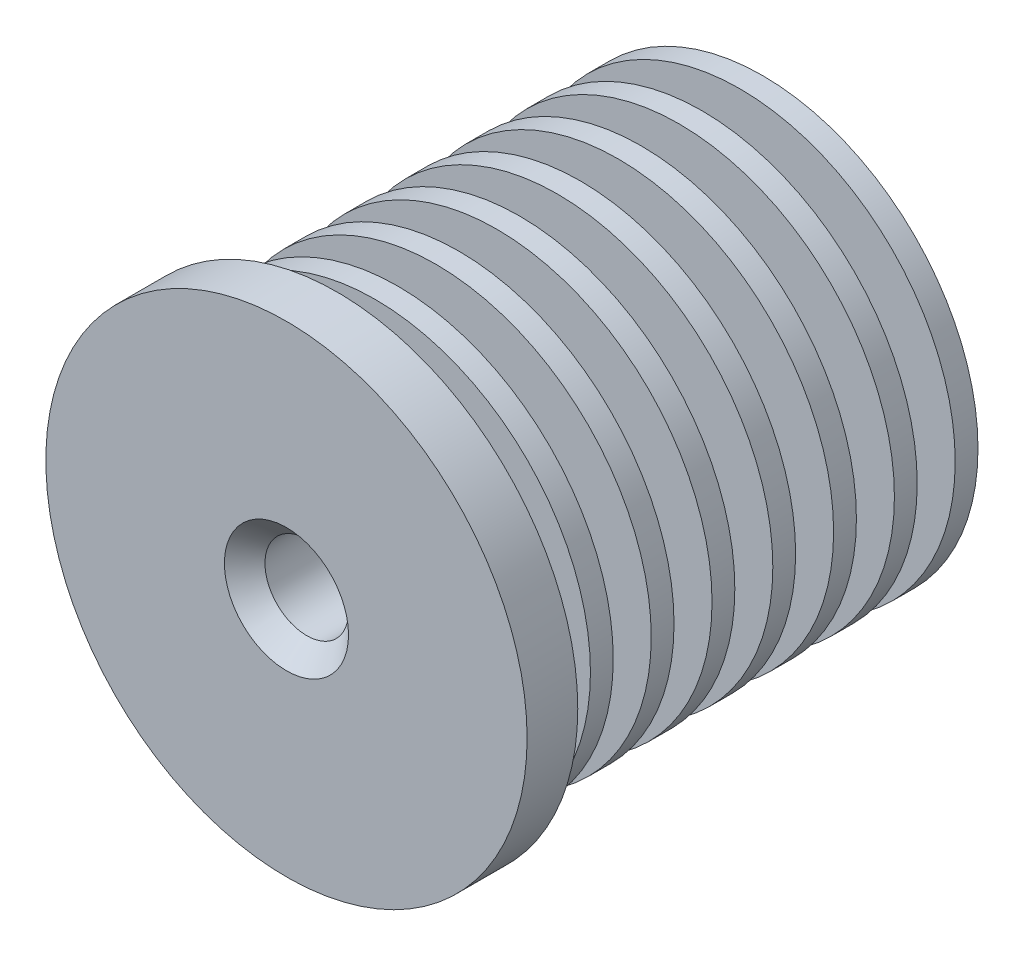
ISO-10303-21;
HEADER;
FILE_DESCRIPTION(('STEP AP214'),'2;1');
FILE_NAME('part.step','',(''),(''),'','','');
FILE_SCHEMA(('AUTOMOTIVE_DESIGN { 1 0 10303 214 1 1 1 1 }'));
ENDSEC;
DATA;
#1=APPLICATION_CONTEXT('core data for automotive mechanical design processes');
#2=APPLICATION_PROTOCOL_DEFINITION('international standard','automotive_design',2000,#1);
#3=PRODUCT_CONTEXT('',#1,'mechanical');
#4=PRODUCT('Part','Part','',(#3));
#5=PRODUCT_RELATED_PRODUCT_CATEGORY('part','',(#4));
#6=PRODUCT_DEFINITION_FORMATION('','',#4);
#7=PRODUCT_DEFINITION_CONTEXT('part definition',#1,'design');
#8=PRODUCT_DEFINITION('design','',#6,#7);
#9=PRODUCT_DEFINITION_SHAPE('','',#8);
#10=(LENGTH_UNIT() NAMED_UNIT(*) SI_UNIT(.MILLI.,.METRE.));
#11=(NAMED_UNIT(*) PLANE_ANGLE_UNIT() SI_UNIT($,.RADIAN.));
#12=(NAMED_UNIT(*) SI_UNIT($,.STERADIAN.) SOLID_ANGLE_UNIT());
#13=UNCERTAINTY_MEASURE_WITH_UNIT(LENGTH_MEASURE(1.E-05),#10,'distance_accuracy_value','');
#14=(GEOMETRIC_REPRESENTATION_CONTEXT(3) GLOBAL_UNCERTAINTY_ASSIGNED_CONTEXT((#13)) GLOBAL_UNIT_ASSIGNED_CONTEXT((#10,
#11,#12)) REPRESENTATION_CONTEXT('',''));
#15=CARTESIAN_POINT('',(0.,0.,0.));
#16=DIRECTION('',(0.,0.,1.));
#17=DIRECTION('',(1.,0.,0.));
#18=AXIS2_PLACEMENT_3D('',#15,#16,#17);
#19=CARTESIAN_POINT('',(0.,0.,0.));
#20=DIRECTION('',(0.,0.,1.));
#21=DIRECTION('',(1.,0.,0.));
#22=AXIS2_PLACEMENT_3D('',#19,#20,#21);
#23=CYLINDRICAL_SURFACE('',#22,6.);
#24=CARTESIAN_POINT('',(0.,0.,-3.5));
#25=DIRECTION('',(0.,0.,1.));
#26=DIRECTION('',(1.,0.,0.));
#27=AXIS2_PLACEMENT_3D('',#24,#25,#26);
#28=CIRCLE('',#27,6.);
#29=CARTESIAN_POINT('',(6.,0.,-3.5));
#30=VERTEX_POINT('',#29);
#31=EDGE_CURVE('E174',#30,#30,#28,.T.);
#32=ORIENTED_EDGE('',*,*,#31,.T.);
#33=EDGE_LOOP('',(#32));
#34=FACE_BOUND('',#33,.T.);
#35=CARTESIAN_POINT('',(0.,0.,-2.));
#36=DIRECTION('',(0.,0.,1.));
#37=DIRECTION('',(1.,0.,0.));
#38=AXIS2_PLACEMENT_3D('',#35,#36,#37);
#39=CIRCLE('',#38,6.);
#40=CARTESIAN_POINT('',(6.,0.,-2.));
#41=VERTEX_POINT('',#40);
#42=EDGE_CURVE('E52',#41,#41,#39,.T.);
#43=ORIENTED_EDGE('',*,*,#42,.F.);
#44=EDGE_LOOP('',(#43));
#45=FACE_BOUND('',#44,.T.);
#46=ADVANCED_FACE('F38',(#34,#45),#23,.T.);
#47=CARTESIAN_POINT('',(9.5,0.,-2.));
#48=DIRECTION('',(0.,0.,-1.));
#49=DIRECTION('',(-1.,0.,0.));
#50=AXIS2_PLACEMENT_3D('',#47,#48,#49);
#51=PLANE('',#50);
#52=ORIENTED_EDGE('',*,*,#42,.T.);
#53=EDGE_LOOP('',(#52));
#54=FACE_BOUND('',#53,.T.);
#55=CARTESIAN_POINT('',(0.,0.,-2.));
#56=DIRECTION('',(0.,0.,1.));
#57=DIRECTION('',(1.,0.,0.));
#58=AXIS2_PLACEMENT_3D('',#55,#56,#57);
#59=CIRCLE('',#58,9.5);
#60=CARTESIAN_POINT('',(9.5,0.,-2.));
#61=VERTEX_POINT('',#60);
#62=EDGE_CURVE('E57',#61,#61,#59,.T.);
#63=ORIENTED_EDGE('',*,*,#62,.F.);
#64=EDGE_LOOP('',(#63));
#65=FACE_BOUND('',#64,.T.);
#66=ADVANCED_FACE('F195',(#54,#65),#51,.T.);
#67=CARTESIAN_POINT('',(0.,0.,0.));
#68=DIRECTION('',(0.,0.,1.));
#69=DIRECTION('',(1.,0.,0.));
#70=AXIS2_PLACEMENT_3D('',#67,#68,#69);
#71=CYLINDRICAL_SURFACE('',#70,9.5);
#72=ORIENTED_EDGE('',*,*,#62,.T.);
#73=EDGE_LOOP('',(#72));
#74=FACE_BOUND('',#73,.T.);
#75=CARTESIAN_POINT('',(0.,0.,0.));
#76=DIRECTION('',(0.,0.,1.));
#77=DIRECTION('',(1.,0.,0.));
#78=AXIS2_PLACEMENT_3D('',#75,#76,#77);
#79=CIRCLE('',#78,9.5);
#80=CARTESIAN_POINT('',(9.5,0.,0.));
#81=VERTEX_POINT('',#80);
#82=EDGE_CURVE('E63',#81,#81,#79,.T.);
#83=ORIENTED_EDGE('',*,*,#82,.F.);
#84=EDGE_LOOP('',(#83));
#85=FACE_BOUND('',#84,.T.);
#86=ADVANCED_FACE('F199',(#74,#85),#71,.T.);
#87=CARTESIAN_POINT('',(1.65,0.,0.));
#88=DIRECTION('',(0.,0.,1.));
#89=DIRECTION('',(1.,0.,0.));
#90=AXIS2_PLACEMENT_3D('',#87,#88,#89);
#91=PLANE('',#90);
#92=CARTESIAN_POINT('',(0.,0.,0.));
#93=DIRECTION('',(0.,0.,1.));
#94=DIRECTION('',(1.,0.,0.));
#95=AXIS2_PLACEMENT_3D('',#92,#93,#94);
#96=CIRCLE('',#95,2.45);
#97=CARTESIAN_POINT('',(2.45,0.,0.));
#98=VERTEX_POINT('',#97);
#99=EDGE_CURVE('E10',#98,#98,#96,.F.);
#100=ORIENTED_EDGE('',*,*,#99,.T.);
#101=EDGE_LOOP('',(#100));
#102=FACE_BOUND('',#101,.T.);
#103=ORIENTED_EDGE('',*,*,#82,.T.);
#104=EDGE_LOOP('',(#103));
#105=FACE_BOUND('',#104,.T.);
#106=ADVANCED_FACE('F205',(#102,#105),#91,.T.);
#107=CARTESIAN_POINT('',(0.,0.,0.));
#108=DIRECTION('',(0.,0.,1.));
#109=DIRECTION('',(1.,0.,0.));
#110=AXIS2_PLACEMENT_3D('',#107,#108,#109);
#111=CYLINDRICAL_SURFACE('',#110,1.65);
#112=CARTESIAN_POINT('',(0.,0.,-0.799999999999995));
#113=DIRECTION('',(0.,0.,1.));
#114=DIRECTION('',(1.,0.,0.));
#115=AXIS2_PLACEMENT_3D('',#112,#113,#114);
#116=CIRCLE('',#115,1.65);
#117=CARTESIAN_POINT('',(1.65,0.,-0.799999999999995));
#118=VERTEX_POINT('',#117);
#119=EDGE_CURVE('E46',#118,#118,#116,.T.);
#120=ORIENTED_EDGE('',*,*,#119,.T.);
#121=EDGE_LOOP('',(#120));
#122=FACE_BOUND('',#121,.T.);
#123=CARTESIAN_POINT('',(0.,0.,-18.8));
#124=DIRECTION('',(0.,0.,1.));
#125=DIRECTION('',(1.,0.,0.));
#126=AXIS2_PLACEMENT_3D('',#123,#124,#125);
#127=CIRCLE('',#126,1.65);
#128=CARTESIAN_POINT('',(1.65,0.,-18.8));
#129=VERTEX_POINT('',#128);
#130=EDGE_CURVE('E67',#129,#129,#127,.T.);
#131=ORIENTED_EDGE('',*,*,#130,.F.);
#132=EDGE_LOOP('',(#131));
#133=FACE_BOUND('',#132,.T.);
#134=ADVANCED_FACE('F209',(#122,#133),#111,.F.);
#135=CARTESIAN_POINT('',(8.5,0.,-18.8));
#136=DIRECTION('',(0.,0.,-1.));
#137=DIRECTION('',(-1.,0.,0.));
#138=AXIS2_PLACEMENT_3D('',#135,#136,#137);
#139=PLANE('',#138);
#140=ORIENTED_EDGE('',*,*,#130,.T.);
#141=EDGE_LOOP('',(#140));
#142=FACE_BOUND('',#141,.T.);
#143=CARTESIAN_POINT('',(0.,0.,-18.8));
#144=DIRECTION('',(0.,0.,1.));
#145=DIRECTION('',(1.,0.,0.));
#146=AXIS2_PLACEMENT_3D('',#143,#144,#145);
#147=CIRCLE('',#146,8.5);
#148=CARTESIAN_POINT('',(8.5,0.,-18.8));
#149=VERTEX_POINT('',#148);
#150=EDGE_CURVE('E70',#149,#149,#147,.T.);
#151=ORIENTED_EDGE('',*,*,#150,.F.);
#152=EDGE_LOOP('',(#151));
#153=FACE_BOUND('',#152,.T.);
#154=ADVANCED_FACE('F212',(#142,#153),#139,.T.);
#155=CARTESIAN_POINT('',(0.,0.,0.));
#156=DIRECTION('',(0.,0.,1.));
#157=DIRECTION('',(1.,0.,0.));
#158=AXIS2_PLACEMENT_3D('',#155,#156,#157);
#159=CYLINDRICAL_SURFACE('',#158,8.5);
#160=ORIENTED_EDGE('',*,*,#150,.T.);
#161=EDGE_LOOP('',(#160));
#162=FACE_BOUND('',#161,.T.);
#163=CARTESIAN_POINT('',(0.,0.,-17.9));
#164=DIRECTION('',(0.,0.,1.));
#165=DIRECTION('',(1.,0.,0.));
#166=AXIS2_PLACEMENT_3D('',#163,#164,#165);
#167=CIRCLE('',#166,8.5);
#168=CARTESIAN_POINT('',(8.5,0.,-17.9));
#169=VERTEX_POINT('',#168);
#170=EDGE_CURVE('E74',#169,#169,#167,.T.);
#171=ORIENTED_EDGE('',*,*,#170,.F.);
#172=EDGE_LOOP('',(#171));
#173=FACE_BOUND('',#172,.T.);
#174=ADVANCED_FACE('F215',(#162,#173),#159,.T.);
#175=CARTESIAN_POINT('',(3.5,0.,-17.9));
#176=DIRECTION('',(0.,0.,1.));
#177=DIRECTION('',(1.,0.,0.));
#178=AXIS2_PLACEMENT_3D('',#175,#176,#177);
#179=PLANE('',#178);
#180=ORIENTED_EDGE('',*,*,#170,.T.);
#181=EDGE_LOOP('',(#180));
#182=FACE_BOUND('',#181,.T.);
#183=CARTESIAN_POINT('',(0.,0.,-17.9));
#184=DIRECTION('',(0.,0.,1.));
#185=DIRECTION('',(1.,0.,0.));
#186=AXIS2_PLACEMENT_3D('',#183,#184,#185);
#187=CIRCLE('',#186,3.5);
#188=CARTESIAN_POINT('',(3.5,0.,-17.9));
#189=VERTEX_POINT('',#188);
#190=EDGE_CURVE('E78',#189,#189,#187,.T.);
#191=ORIENTED_EDGE('',*,*,#190,.F.);
#192=EDGE_LOOP('',(#191));
#193=FACE_BOUND('',#192,.T.);
#194=ADVANCED_FACE('F219',(#182,#193),#179,.T.);
#195=CARTESIAN_POINT('',(0.,0.,0.));
#196=DIRECTION('',(0.,0.,1.));
#197=DIRECTION('',(1.,0.,0.));
#198=AXIS2_PLACEMENT_3D('',#195,#196,#197);
#199=CYLINDRICAL_SURFACE('',#198,3.5);
#200=ORIENTED_EDGE('',*,*,#190,.T.);
#201=EDGE_LOOP('',(#200));
#202=FACE_BOUND('',#201,.T.);
#203=CARTESIAN_POINT('',(0.,0.,-16.4));
#204=DIRECTION('',(0.,0.,1.));
#205=DIRECTION('',(1.,0.,0.));
#206=AXIS2_PLACEMENT_3D('',#203,#204,#205);
#207=CIRCLE('',#206,3.5);
#208=CARTESIAN_POINT('',(3.5,0.,-16.4));
#209=VERTEX_POINT('',#208);
#210=EDGE_CURVE('E82',#209,#209,#207,.T.);
#211=ORIENTED_EDGE('',*,*,#210,.F.);
#212=EDGE_LOOP('',(#211));
#213=FACE_BOUND('',#212,.T.);
#214=ADVANCED_FACE('F223',(#202,#213),#199,.T.);
#215=CARTESIAN_POINT('',(8.5,0.,-16.4));
#216=DIRECTION('',(0.,0.,-1.));
#217=DIRECTION('',(-1.,0.,0.));
#218=AXIS2_PLACEMENT_3D('',#215,#216,#217);
#219=PLANE('',#218);
#220=ORIENTED_EDGE('',*,*,#210,.T.);
#221=EDGE_LOOP('',(#220));
#222=FACE_BOUND('',#221,.T.);
#223=CARTESIAN_POINT('',(0.,0.,-16.4));
#224=DIRECTION('',(0.,0.,1.));
#225=DIRECTION('',(1.,0.,0.));
#226=AXIS2_PLACEMENT_3D('',#223,#224,#225);
#227=CIRCLE('',#226,8.5);
#228=CARTESIAN_POINT('',(8.5,0.,-16.4));
#229=VERTEX_POINT('',#228);
#230=EDGE_CURVE('E86',#229,#229,#227,.T.);
#231=ORIENTED_EDGE('',*,*,#230,.F.);
#232=EDGE_LOOP('',(#231));
#233=FACE_BOUND('',#232,.T.);
#234=ADVANCED_FACE('F227',(#222,#233),#219,.T.);
#235=CARTESIAN_POINT('',(0.,0.,0.));
#236=DIRECTION('',(0.,0.,1.));
#237=DIRECTION('',(1.,0.,0.));
#238=AXIS2_PLACEMENT_3D('',#235,#236,#237);
#239=CYLINDRICAL_SURFACE('',#238,8.5);
#240=ORIENTED_EDGE('',*,*,#230,.T.);
#241=EDGE_LOOP('',(#240));
#242=FACE_BOUND('',#241,.T.);
#243=CARTESIAN_POINT('',(0.,0.,-15.5));
#244=DIRECTION('',(0.,0.,1.));
#245=DIRECTION('',(1.,0.,0.));
#246=AXIS2_PLACEMENT_3D('',#243,#244,#245);
#247=CIRCLE('',#246,8.5);
#248=CARTESIAN_POINT('',(8.5,0.,-15.5));
#249=VERTEX_POINT('',#248);
#250=EDGE_CURVE('E90',#249,#249,#247,.T.);
#251=ORIENTED_EDGE('',*,*,#250,.F.);
#252=EDGE_LOOP('',(#251));
#253=FACE_BOUND('',#252,.T.);
#254=ADVANCED_FACE('F231',(#242,#253),#239,.T.);
#255=CARTESIAN_POINT('',(3.5,0.,-15.5));
#256=DIRECTION('',(0.,0.,1.));
#257=DIRECTION('',(1.,0.,0.));
#258=AXIS2_PLACEMENT_3D('',#255,#256,#257);
#259=PLANE('',#258);
#260=ORIENTED_EDGE('',*,*,#250,.T.);
#261=EDGE_LOOP('',(#260));
#262=FACE_BOUND('',#261,.T.);
#263=CARTESIAN_POINT('',(0.,0.,-15.5));
#264=DIRECTION('',(0.,0.,1.));
#265=DIRECTION('',(1.,0.,0.));
#266=AXIS2_PLACEMENT_3D('',#263,#264,#265);
#267=CIRCLE('',#266,3.5);
#268=CARTESIAN_POINT('',(3.5,0.,-15.5));
#269=VERTEX_POINT('',#268);
#270=EDGE_CURVE('E94',#269,#269,#267,.T.);
#271=ORIENTED_EDGE('',*,*,#270,.F.);
#272=EDGE_LOOP('',(#271));
#273=FACE_BOUND('',#272,.T.);
#274=ADVANCED_FACE('F235',(#262,#273),#259,.T.);
#275=CARTESIAN_POINT('',(0.,0.,0.));
#276=DIRECTION('',(0.,0.,1.));
#277=DIRECTION('',(1.,0.,0.));
#278=AXIS2_PLACEMENT_3D('',#275,#276,#277);
#279=CYLINDRICAL_SURFACE('',#278,3.5);
#280=ORIENTED_EDGE('',*,*,#270,.T.);
#281=EDGE_LOOP('',(#280));
#282=FACE_BOUND('',#281,.T.);
#283=CARTESIAN_POINT('',(0.,0.,-14.));
#284=DIRECTION('',(0.,0.,1.));
#285=DIRECTION('',(1.,0.,0.));
#286=AXIS2_PLACEMENT_3D('',#283,#284,#285);
#287=CIRCLE('',#286,3.5);
#288=CARTESIAN_POINT('',(3.5,0.,-14.));
#289=VERTEX_POINT('',#288);
#290=EDGE_CURVE('E98',#289,#289,#287,.T.);
#291=ORIENTED_EDGE('',*,*,#290,.F.);
#292=EDGE_LOOP('',(#291));
#293=FACE_BOUND('',#292,.T.);
#294=ADVANCED_FACE('F239',(#282,#293),#279,.T.);
#295=CARTESIAN_POINT('',(8.5,0.,-14.));
#296=DIRECTION('',(0.,0.,-1.));
#297=DIRECTION('',(-1.,0.,0.));
#298=AXIS2_PLACEMENT_3D('',#295,#296,#297);
#299=PLANE('',#298);
#300=ORIENTED_EDGE('',*,*,#290,.T.);
#301=EDGE_LOOP('',(#300));
#302=FACE_BOUND('',#301,.T.);
#303=CARTESIAN_POINT('',(0.,0.,-14.));
#304=DIRECTION('',(0.,0.,1.));
#305=DIRECTION('',(1.,0.,0.));
#306=AXIS2_PLACEMENT_3D('',#303,#304,#305);
#307=CIRCLE('',#306,8.5);
#308=CARTESIAN_POINT('',(8.5,0.,-14.));
#309=VERTEX_POINT('',#308);
#310=EDGE_CURVE('E102',#309,#309,#307,.T.);
#311=ORIENTED_EDGE('',*,*,#310,.F.);
#312=EDGE_LOOP('',(#311));
#313=FACE_BOUND('',#312,.T.);
#314=ADVANCED_FACE('F243',(#302,#313),#299,.T.);
#315=CARTESIAN_POINT('',(0.,0.,0.));
#316=DIRECTION('',(0.,0.,1.));
#317=DIRECTION('',(1.,0.,0.));
#318=AXIS2_PLACEMENT_3D('',#315,#316,#317);
#319=CYLINDRICAL_SURFACE('',#318,8.5);
#320=ORIENTED_EDGE('',*,*,#310,.T.);
#321=EDGE_LOOP('',(#320));
#322=FACE_BOUND('',#321,.T.);
#323=CARTESIAN_POINT('',(0.,0.,-13.1));
#324=DIRECTION('',(0.,0.,1.));
#325=DIRECTION('',(1.,0.,0.));
#326=AXIS2_PLACEMENT_3D('',#323,#324,#325);
#327=CIRCLE('',#326,8.5);
#328=CARTESIAN_POINT('',(8.5,0.,-13.1));
#329=VERTEX_POINT('',#328);
#330=EDGE_CURVE('E106',#329,#329,#327,.T.);
#331=ORIENTED_EDGE('',*,*,#330,.F.);
#332=EDGE_LOOP('',(#331));
#333=FACE_BOUND('',#332,.T.);
#334=ADVANCED_FACE('F247',(#322,#333),#319,.T.);
#335=CARTESIAN_POINT('',(3.5,0.,-13.1));
#336=DIRECTION('',(0.,0.,1.));
#337=DIRECTION('',(1.,0.,0.));
#338=AXIS2_PLACEMENT_3D('',#335,#336,#337);
#339=PLANE('',#338);
#340=ORIENTED_EDGE('',*,*,#330,.T.);
#341=EDGE_LOOP('',(#340));
#342=FACE_BOUND('',#341,.T.);
#343=CARTESIAN_POINT('',(0.,0.,-13.1));
#344=DIRECTION('',(0.,0.,1.));
#345=DIRECTION('',(1.,0.,0.));
#346=AXIS2_PLACEMENT_3D('',#343,#344,#345);
#347=CIRCLE('',#346,3.5);
#348=CARTESIAN_POINT('',(3.5,0.,-13.1));
#349=VERTEX_POINT('',#348);
#350=EDGE_CURVE('E110',#349,#349,#347,.T.);
#351=ORIENTED_EDGE('',*,*,#350,.F.);
#352=EDGE_LOOP('',(#351));
#353=FACE_BOUND('',#352,.T.);
#354=ADVANCED_FACE('F251',(#342,#353),#339,.T.);
#355=CARTESIAN_POINT('',(0.,0.,0.));
#356=DIRECTION('',(0.,0.,1.));
#357=DIRECTION('',(1.,0.,0.));
#358=AXIS2_PLACEMENT_3D('',#355,#356,#357);
#359=CYLINDRICAL_SURFACE('',#358,3.5);
#360=ORIENTED_EDGE('',*,*,#350,.T.);
#361=EDGE_LOOP('',(#360));
#362=FACE_BOUND('',#361,.T.);
#363=CARTESIAN_POINT('',(0.,0.,-11.6));
#364=DIRECTION('',(0.,0.,1.));
#365=DIRECTION('',(1.,0.,0.));
#366=AXIS2_PLACEMENT_3D('',#363,#364,#365);
#367=CIRCLE('',#366,3.5);
#368=CARTESIAN_POINT('',(3.5,0.,-11.6));
#369=VERTEX_POINT('',#368);
#370=EDGE_CURVE('E114',#369,#369,#367,.T.);
#371=ORIENTED_EDGE('',*,*,#370,.F.);
#372=EDGE_LOOP('',(#371));
#373=FACE_BOUND('',#372,.T.);
#374=ADVANCED_FACE('F255',(#362,#373),#359,.T.);
#375=CARTESIAN_POINT('',(8.5,0.,-11.6));
#376=DIRECTION('',(0.,0.,-1.));
#377=DIRECTION('',(-1.,0.,0.));
#378=AXIS2_PLACEMENT_3D('',#375,#376,#377);
#379=PLANE('',#378);
#380=ORIENTED_EDGE('',*,*,#370,.T.);
#381=EDGE_LOOP('',(#380));
#382=FACE_BOUND('',#381,.T.);
#383=CARTESIAN_POINT('',(0.,0.,-11.6));
#384=DIRECTION('',(0.,0.,1.));
#385=DIRECTION('',(1.,0.,0.));
#386=AXIS2_PLACEMENT_3D('',#383,#384,#385);
#387=CIRCLE('',#386,8.5);
#388=CARTESIAN_POINT('',(8.5,0.,-11.6));
#389=VERTEX_POINT('',#388);
#390=EDGE_CURVE('E118',#389,#389,#387,.T.);
#391=ORIENTED_EDGE('',*,*,#390,.F.);
#392=EDGE_LOOP('',(#391));
#393=FACE_BOUND('',#392,.T.);
#394=ADVANCED_FACE('F259',(#382,#393),#379,.T.);
#395=CARTESIAN_POINT('',(0.,0.,0.));
#396=DIRECTION('',(0.,0.,1.));
#397=DIRECTION('',(1.,0.,0.));
#398=AXIS2_PLACEMENT_3D('',#395,#396,#397);
#399=CYLINDRICAL_SURFACE('',#398,8.5);
#400=ORIENTED_EDGE('',*,*,#390,.T.);
#401=EDGE_LOOP('',(#400));
#402=FACE_BOUND('',#401,.T.);
#403=CARTESIAN_POINT('',(0.,0.,-10.7));
#404=DIRECTION('',(0.,0.,1.));
#405=DIRECTION('',(1.,0.,0.));
#406=AXIS2_PLACEMENT_3D('',#403,#404,#405);
#407=CIRCLE('',#406,8.5);
#408=CARTESIAN_POINT('',(8.5,0.,-10.7));
#409=VERTEX_POINT('',#408);
#410=EDGE_CURVE('E122',#409,#409,#407,.T.);
#411=ORIENTED_EDGE('',*,*,#410,.F.);
#412=EDGE_LOOP('',(#411));
#413=FACE_BOUND('',#412,.T.);
#414=ADVANCED_FACE('F263',(#402,#413),#399,.T.);
#415=CARTESIAN_POINT('',(3.5,0.,-10.7));
#416=DIRECTION('',(0.,0.,1.));
#417=DIRECTION('',(1.,0.,0.));
#418=AXIS2_PLACEMENT_3D('',#415,#416,#417);
#419=PLANE('',#418);
#420=ORIENTED_EDGE('',*,*,#410,.T.);
#421=EDGE_LOOP('',(#420));
#422=FACE_BOUND('',#421,.T.);
#423=CARTESIAN_POINT('',(0.,0.,-10.7));
#424=DIRECTION('',(0.,0.,1.));
#425=DIRECTION('',(1.,0.,0.));
#426=AXIS2_PLACEMENT_3D('',#423,#424,#425);
#427=CIRCLE('',#426,3.5);
#428=CARTESIAN_POINT('',(3.5,0.,-10.7));
#429=VERTEX_POINT('',#428);
#430=EDGE_CURVE('E126',#429,#429,#427,.T.);
#431=ORIENTED_EDGE('',*,*,#430,.F.);
#432=EDGE_LOOP('',(#431));
#433=FACE_BOUND('',#432,.T.);
#434=ADVANCED_FACE('F267',(#422,#433),#419,.T.);
#435=CARTESIAN_POINT('',(0.,0.,0.));
#436=DIRECTION('',(0.,0.,1.));
#437=DIRECTION('',(1.,0.,0.));
#438=AXIS2_PLACEMENT_3D('',#435,#436,#437);
#439=CYLINDRICAL_SURFACE('',#438,3.5);
#440=ORIENTED_EDGE('',*,*,#430,.T.);
#441=EDGE_LOOP('',(#440));
#442=FACE_BOUND('',#441,.T.);
#443=CARTESIAN_POINT('',(0.,0.,-9.19999999999999));
#444=DIRECTION('',(0.,0.,1.));
#445=DIRECTION('',(1.,0.,0.));
#446=AXIS2_PLACEMENT_3D('',#443,#444,#445);
#447=CIRCLE('',#446,3.5);
#448=CARTESIAN_POINT('',(3.5,0.,-9.19999999999999));
#449=VERTEX_POINT('',#448);
#450=EDGE_CURVE('E130',#449,#449,#447,.T.);
#451=ORIENTED_EDGE('',*,*,#450,.F.);
#452=EDGE_LOOP('',(#451));
#453=FACE_BOUND('',#452,.T.);
#454=ADVANCED_FACE('F271',(#442,#453),#439,.T.);
#455=CARTESIAN_POINT('',(8.5,0.,-9.19999999999999));
#456=DIRECTION('',(0.,0.,-1.));
#457=DIRECTION('',(-1.,0.,0.));
#458=AXIS2_PLACEMENT_3D('',#455,#456,#457);
#459=PLANE('',#458);
#460=ORIENTED_EDGE('',*,*,#450,.T.);
#461=EDGE_LOOP('',(#460));
#462=FACE_BOUND('',#461,.T.);
#463=CARTESIAN_POINT('',(0.,0.,-9.19999999999999));
#464=DIRECTION('',(0.,0.,1.));
#465=DIRECTION('',(1.,0.,0.));
#466=AXIS2_PLACEMENT_3D('',#463,#464,#465);
#467=CIRCLE('',#466,8.5);
#468=CARTESIAN_POINT('',(8.5,0.,-9.19999999999999));
#469=VERTEX_POINT('',#468);
#470=EDGE_CURVE('E134',#469,#469,#467,.T.);
#471=ORIENTED_EDGE('',*,*,#470,.F.);
#472=EDGE_LOOP('',(#471));
#473=FACE_BOUND('',#472,.T.);
#474=ADVANCED_FACE('F275',(#462,#473),#459,.T.);
#475=CARTESIAN_POINT('',(0.,0.,0.));
#476=DIRECTION('',(0.,0.,1.));
#477=DIRECTION('',(1.,0.,0.));
#478=AXIS2_PLACEMENT_3D('',#475,#476,#477);
#479=CYLINDRICAL_SURFACE('',#478,8.5);
#480=ORIENTED_EDGE('',*,*,#470,.T.);
#481=EDGE_LOOP('',(#480));
#482=FACE_BOUND('',#481,.T.);
#483=CARTESIAN_POINT('',(0.,0.,-8.29999999999999));
#484=DIRECTION('',(0.,0.,1.));
#485=DIRECTION('',(1.,0.,0.));
#486=AXIS2_PLACEMENT_3D('',#483,#484,#485);
#487=CIRCLE('',#486,8.5);
#488=CARTESIAN_POINT('',(8.5,0.,-8.29999999999999));
#489=VERTEX_POINT('',#488);
#490=EDGE_CURVE('E138',#489,#489,#487,.T.);
#491=ORIENTED_EDGE('',*,*,#490,.F.);
#492=EDGE_LOOP('',(#491));
#493=FACE_BOUND('',#492,.T.);
#494=ADVANCED_FACE('F279',(#482,#493),#479,.T.);
#495=CARTESIAN_POINT('',(3.5,0.,-8.29999999999999));
#496=DIRECTION('',(0.,0.,1.));
#497=DIRECTION('',(1.,0.,0.));
#498=AXIS2_PLACEMENT_3D('',#495,#496,#497);
#499=PLANE('',#498);
#500=ORIENTED_EDGE('',*,*,#490,.T.);
#501=EDGE_LOOP('',(#500));
#502=FACE_BOUND('',#501,.T.);
#503=CARTESIAN_POINT('',(0.,0.,-8.29999999999999));
#504=DIRECTION('',(0.,0.,1.));
#505=DIRECTION('',(1.,0.,0.));
#506=AXIS2_PLACEMENT_3D('',#503,#504,#505);
#507=CIRCLE('',#506,3.5);
#508=CARTESIAN_POINT('',(3.5,0.,-8.29999999999999));
#509=VERTEX_POINT('',#508);
#510=EDGE_CURVE('E142',#509,#509,#507,.T.);
#511=ORIENTED_EDGE('',*,*,#510,.F.);
#512=EDGE_LOOP('',(#511));
#513=FACE_BOUND('',#512,.T.);
#514=ADVANCED_FACE('F283',(#502,#513),#499,.T.);
#515=CARTESIAN_POINT('',(0.,0.,0.));
#516=DIRECTION('',(0.,0.,1.));
#517=DIRECTION('',(1.,0.,0.));
#518=AXIS2_PLACEMENT_3D('',#515,#516,#517);
#519=CYLINDRICAL_SURFACE('',#518,3.5);
#520=ORIENTED_EDGE('',*,*,#510,.T.);
#521=EDGE_LOOP('',(#520));
#522=FACE_BOUND('',#521,.T.);
#523=CARTESIAN_POINT('',(0.,0.,-6.79999999999999));
#524=DIRECTION('',(0.,0.,1.));
#525=DIRECTION('',(1.,0.,0.));
#526=AXIS2_PLACEMENT_3D('',#523,#524,#525);
#527=CIRCLE('',#526,3.5);
#528=CARTESIAN_POINT('',(3.5,0.,-6.79999999999999));
#529=VERTEX_POINT('',#528);
#530=EDGE_CURVE('E146',#529,#529,#527,.T.);
#531=ORIENTED_EDGE('',*,*,#530,.F.);
#532=EDGE_LOOP('',(#531));
#533=FACE_BOUND('',#532,.T.);
#534=ADVANCED_FACE('F287',(#522,#533),#519,.T.);
#535=CARTESIAN_POINT('',(8.5,0.,-6.79999999999999));
#536=DIRECTION('',(0.,0.,-1.));
#537=DIRECTION('',(-1.,0.,0.));
#538=AXIS2_PLACEMENT_3D('',#535,#536,#537);
#539=PLANE('',#538);
#540=ORIENTED_EDGE('',*,*,#530,.T.);
#541=EDGE_LOOP('',(#540));
#542=FACE_BOUND('',#541,.T.);
#543=CARTESIAN_POINT('',(0.,0.,-6.79999999999999));
#544=DIRECTION('',(0.,0.,1.));
#545=DIRECTION('',(1.,0.,0.));
#546=AXIS2_PLACEMENT_3D('',#543,#544,#545);
#547=CIRCLE('',#546,8.5);
#548=CARTESIAN_POINT('',(8.5,0.,-6.79999999999999));
#549=VERTEX_POINT('',#548);
#550=EDGE_CURVE('E150',#549,#549,#547,.T.);
#551=ORIENTED_EDGE('',*,*,#550,.F.);
#552=EDGE_LOOP('',(#551));
#553=FACE_BOUND('',#552,.T.);
#554=ADVANCED_FACE('F291',(#542,#553),#539,.T.);
#555=CARTESIAN_POINT('',(0.,0.,0.));
#556=DIRECTION('',(0.,0.,1.));
#557=DIRECTION('',(1.,0.,0.));
#558=AXIS2_PLACEMENT_3D('',#555,#556,#557);
#559=CYLINDRICAL_SURFACE('',#558,8.5);
#560=ORIENTED_EDGE('',*,*,#550,.T.);
#561=EDGE_LOOP('',(#560));
#562=FACE_BOUND('',#561,.T.);
#563=CARTESIAN_POINT('',(0.,0.,-5.89999999999999));
#564=DIRECTION('',(0.,0.,1.));
#565=DIRECTION('',(1.,0.,0.));
#566=AXIS2_PLACEMENT_3D('',#563,#564,#565);
#567=CIRCLE('',#566,8.5);
#568=CARTESIAN_POINT('',(8.5,0.,-5.89999999999999));
#569=VERTEX_POINT('',#568);
#570=EDGE_CURVE('E154',#569,#569,#567,.T.);
#571=ORIENTED_EDGE('',*,*,#570,.F.);
#572=EDGE_LOOP('',(#571));
#573=FACE_BOUND('',#572,.T.);
#574=ADVANCED_FACE('F295',(#562,#573),#559,.T.);
#575=CARTESIAN_POINT('',(3.5,0.,-5.89999999999999));
#576=DIRECTION('',(0.,0.,1.));
#577=DIRECTION('',(1.,0.,0.));
#578=AXIS2_PLACEMENT_3D('',#575,#576,#577);
#579=PLANE('',#578);
#580=ORIENTED_EDGE('',*,*,#570,.T.);
#581=EDGE_LOOP('',(#580));
#582=FACE_BOUND('',#581,.T.);
#583=CARTESIAN_POINT('',(0.,0.,-5.89999999999999));
#584=DIRECTION('',(0.,0.,1.));
#585=DIRECTION('',(1.,0.,0.));
#586=AXIS2_PLACEMENT_3D('',#583,#584,#585);
#587=CIRCLE('',#586,3.5);
#588=CARTESIAN_POINT('',(3.5,0.,-5.89999999999999));
#589=VERTEX_POINT('',#588);
#590=EDGE_CURVE('E158',#589,#589,#587,.T.);
#591=ORIENTED_EDGE('',*,*,#590,.F.);
#592=EDGE_LOOP('',(#591));
#593=FACE_BOUND('',#592,.T.);
#594=ADVANCED_FACE('F299',(#582,#593),#579,.T.);
#595=CARTESIAN_POINT('',(0.,0.,0.));
#596=DIRECTION('',(0.,0.,1.));
#597=DIRECTION('',(1.,0.,0.));
#598=AXIS2_PLACEMENT_3D('',#595,#596,#597);
#599=CYLINDRICAL_SURFACE('',#598,3.5);
#600=ORIENTED_EDGE('',*,*,#590,.T.);
#601=EDGE_LOOP('',(#600));
#602=FACE_BOUND('',#601,.T.);
#603=CARTESIAN_POINT('',(0.,0.,-4.4));
#604=DIRECTION('',(0.,0.,1.));
#605=DIRECTION('',(1.,0.,0.));
#606=AXIS2_PLACEMENT_3D('',#603,#604,#605);
#607=CIRCLE('',#606,3.5);
#608=CARTESIAN_POINT('',(3.5,0.,-4.4));
#609=VERTEX_POINT('',#608);
#610=EDGE_CURVE('E162',#609,#609,#607,.T.);
#611=ORIENTED_EDGE('',*,*,#610,.F.);
#612=EDGE_LOOP('',(#611));
#613=FACE_BOUND('',#612,.T.);
#614=ADVANCED_FACE('F303',(#602,#613),#599,.T.);
#615=CARTESIAN_POINT('',(8.5,0.,-4.4));
#616=DIRECTION('',(0.,0.,-1.));
#617=DIRECTION('',(-1.,0.,0.));
#618=AXIS2_PLACEMENT_3D('',#615,#616,#617);
#619=PLANE('',#618);
#620=ORIENTED_EDGE('',*,*,#610,.T.);
#621=EDGE_LOOP('',(#620));
#622=FACE_BOUND('',#621,.T.);
#623=CARTESIAN_POINT('',(0.,0.,-4.4));
#624=DIRECTION('',(0.,0.,1.));
#625=DIRECTION('',(1.,0.,0.));
#626=AXIS2_PLACEMENT_3D('',#623,#624,#625);
#627=CIRCLE('',#626,8.5);
#628=CARTESIAN_POINT('',(8.5,0.,-4.4));
#629=VERTEX_POINT('',#628);
#630=EDGE_CURVE('E166',#629,#629,#627,.T.);
#631=ORIENTED_EDGE('',*,*,#630,.F.);
#632=EDGE_LOOP('',(#631));
#633=FACE_BOUND('',#632,.T.);
#634=ADVANCED_FACE('F191',(#622,#633),#619,.T.);
#635=CARTESIAN_POINT('',(0.,0.,0.));
#636=DIRECTION('',(0.,0.,1.));
#637=DIRECTION('',(1.,0.,0.));
#638=AXIS2_PLACEMENT_3D('',#635,#636,#637);
#639=CYLINDRICAL_SURFACE('',#638,8.5);
#640=ORIENTED_EDGE('',*,*,#630,.T.);
#641=EDGE_LOOP('',(#640));
#642=FACE_BOUND('',#641,.T.);
#643=CARTESIAN_POINT('',(0.,0.,-3.5));
#644=DIRECTION('',(0.,0.,1.));
#645=DIRECTION('',(1.,0.,0.));
#646=AXIS2_PLACEMENT_3D('',#643,#644,#645);
#647=CIRCLE('',#646,8.5);
#648=CARTESIAN_POINT('',(8.5,0.,-3.5));
#649=VERTEX_POINT('',#648);
#650=EDGE_CURVE('E170',#649,#649,#647,.T.);
#651=ORIENTED_EDGE('',*,*,#650,.F.);
#652=EDGE_LOOP('',(#651));
#653=FACE_BOUND('',#652,.T.);
#654=ADVANCED_FACE('F183',(#642,#653),#639,.T.);
#655=CARTESIAN_POINT('',(6.,0.,-3.5));
#656=DIRECTION('',(0.,0.,1.));
#657=DIRECTION('',(1.,0.,0.));
#658=AXIS2_PLACEMENT_3D('',#655,#656,#657);
#659=PLANE('',#658);
#660=ORIENTED_EDGE('',*,*,#650,.T.);
#661=EDGE_LOOP('',(#660));
#662=FACE_BOUND('',#661,.T.);
#663=ORIENTED_EDGE('',*,*,#31,.F.);
#664=EDGE_LOOP('',(#663));
#665=FACE_BOUND('',#664,.T.);
#666=ADVANCED_FACE('F181',(#662,#665),#659,.T.);
#667=CARTESIAN_POINT('',(0.,0.,-0.799999999999995));
#668=DIRECTION('',(0.,0.,1.));
#669=DIRECTION('',(1.,0.,0.));
#670=AXIS2_PLACEMENT_3D('',#667,#668,#669);
#671=CONICAL_SURFACE('',#670,1.65,0.785398163397451);
#672=ORIENTED_EDGE('',*,*,#99,.F.);
#673=EDGE_LOOP('',(#672));
#674=FACE_BOUND('',#673,.T.);
#675=ORIENTED_EDGE('',*,*,#119,.F.);
#676=EDGE_LOOP('',(#675));
#677=FACE_BOUND('',#676,.T.);
#678=ADVANCED_FACE('F40',(#674,#677),#671,.F.);
#679=CLOSED_SHELL('',(#46,#66,#86,#106,#134,#154,#174,#194,#214,#234,#254,#274,#294,#314,#334,
#354,#374,#394,#414,#434,#454,#474,#494,#514,#534,#554,#574,#594,#614,#634,#654,#666,#678));
#680=MANIFOLD_SOLID_BREP('B2',#679);
#681=ADVANCED_BREP_SHAPE_REPRESENTATION('',(#18,#680),#14);
#682=SHAPE_DEFINITION_REPRESENTATION(#9,#681);
ENDSEC;
END-ISO-10303-21;
